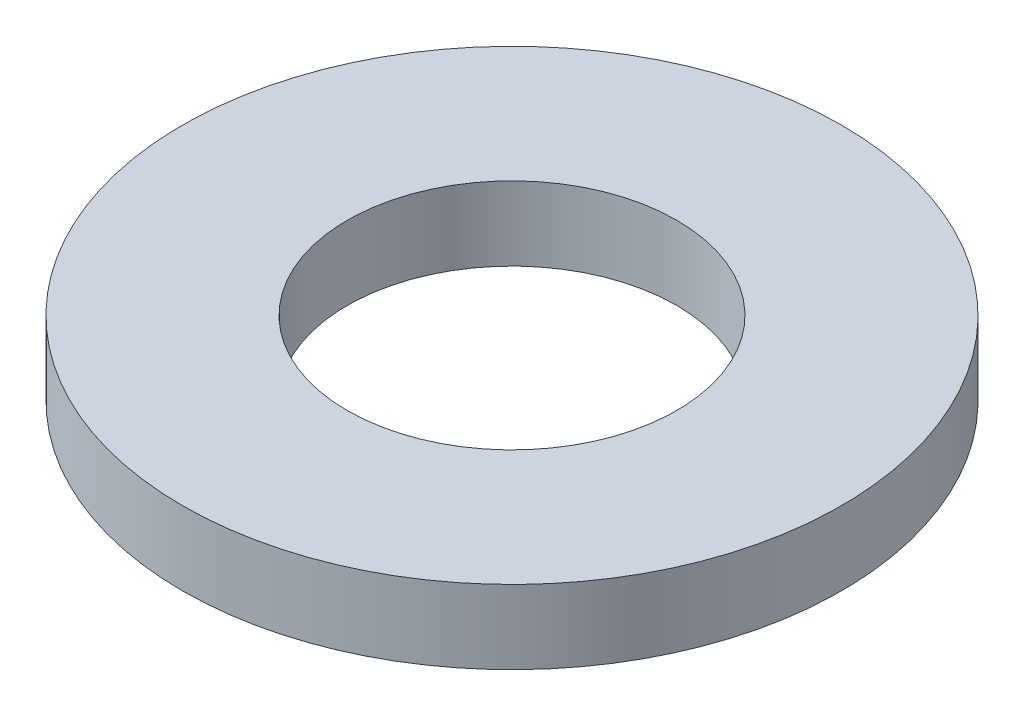
ISO-10303-21;
HEADER;
FILE_DESCRIPTION(('STEP AP214'),'2;1');
FILE_NAME('part.step','',(''),(''),'','','');
FILE_SCHEMA(('AUTOMOTIVE_DESIGN { 1 0 10303 214 1 1 1 1 }'));
ENDSEC;
DATA;
#1=APPLICATION_CONTEXT('core data for automotive mechanical design processes');
#2=APPLICATION_PROTOCOL_DEFINITION('international standard','automotive_design',2000,#1);
#3=PRODUCT_CONTEXT('',#1,'mechanical');
#4=PRODUCT('Part','Part','',(#3));
#5=PRODUCT_RELATED_PRODUCT_CATEGORY('part','',(#4));
#6=PRODUCT_DEFINITION_FORMATION('','',#4);
#7=PRODUCT_DEFINITION_CONTEXT('part definition',#1,'design');
#8=PRODUCT_DEFINITION('design','',#6,#7);
#9=PRODUCT_DEFINITION_SHAPE('','',#8);
#10=(LENGTH_UNIT() NAMED_UNIT(*) SI_UNIT(.MILLI.,.METRE.));
#11=(NAMED_UNIT(*) PLANE_ANGLE_UNIT() SI_UNIT($,.RADIAN.));
#12=(NAMED_UNIT(*) SI_UNIT($,.STERADIAN.) SOLID_ANGLE_UNIT());
#13=UNCERTAINTY_MEASURE_WITH_UNIT(LENGTH_MEASURE(1.E-05),#10,'distance_accuracy_value','');
#14=(GEOMETRIC_REPRESENTATION_CONTEXT(3) GLOBAL_UNCERTAINTY_ASSIGNED_CONTEXT((#13)) GLOBAL_UNIT_ASSIGNED_CONTEXT((#10,
#11,#12)) REPRESENTATION_CONTEXT('',''));
#15=CARTESIAN_POINT('',(0.,0.,0.));
#16=DIRECTION('',(0.,0.,1.));
#17=DIRECTION('',(1.,0.,0.));
#18=AXIS2_PLACEMENT_3D('',#15,#16,#17);
#19=CARTESIAN_POINT('',(0.,0.7112,0.));
#20=DIRECTION('',(0.,-1.,0.));
#21=DIRECTION('',(0.,0.,-1.));
#22=AXIS2_PLACEMENT_3D('',#19,#20,#21);
#23=CYLINDRICAL_SURFACE('',#22,3.175);
#24=CARTESIAN_POINT('',(0.,0.7112,0.));
#25=DIRECTION('',(0.,1.,0.));
#26=DIRECTION('',(0.,0.,1.));
#27=AXIS2_PLACEMENT_3D('',#24,#25,#26);
#28=CIRCLE('',#27,3.175);
#29=CARTESIAN_POINT('',(0.,0.7112,3.175));
#30=VERTEX_POINT('',#29);
#31=EDGE_CURVE('E12',#30,#30,#28,.T.);
#32=ORIENTED_EDGE('',*,*,#31,.F.);
#33=EDGE_LOOP('',(#32));
#34=FACE_BOUND('',#33,.T.);
#35=CARTESIAN_POINT('',(0.,0.,0.));
#36=DIRECTION('',(0.,1.,0.));
#37=DIRECTION('',(0.,0.,1.));
#38=AXIS2_PLACEMENT_3D('',#35,#36,#37);
#39=CIRCLE('',#38,3.175);
#40=CARTESIAN_POINT('',(0.,0.,3.175));
#41=VERTEX_POINT('',#40);
#42=EDGE_CURVE('E45',#41,#41,#39,.T.);
#43=ORIENTED_EDGE('',*,*,#42,.T.);
#44=EDGE_LOOP('',(#43));
#45=FACE_BOUND('',#44,.T.);
#46=ADVANCED_FACE('F42',(#34,#45),#23,.T.);
#47=CARTESIAN_POINT('',(0.,0.7112,0.));
#48=DIRECTION('',(0.,1.,0.));
#49=DIRECTION('',(0.,0.,1.));
#50=AXIS2_PLACEMENT_3D('',#47,#48,#49);
#51=PLANE('',#50);
#52=CARTESIAN_POINT('',(0.,0.7112,0.));
#53=DIRECTION('',(0.,1.,0.));
#54=DIRECTION('',(0.,0.,1.));
#55=AXIS2_PLACEMENT_3D('',#52,#53,#54);
#56=CIRCLE('',#55,1.5875);
#57=CARTESIAN_POINT('',(0.,0.7112,1.5875));
#58=VERTEX_POINT('',#57);
#59=EDGE_CURVE('E54',#58,#58,#56,.T.);
#60=ORIENTED_EDGE('',*,*,#59,.F.);
#61=EDGE_LOOP('',(#60));
#62=FACE_BOUND('',#61,.T.);
#63=ORIENTED_EDGE('',*,*,#31,.T.);
#64=EDGE_LOOP('',(#63));
#65=FACE_BOUND('',#64,.T.);
#66=ADVANCED_FACE('F69',(#62,#65),#51,.T.);
#67=CARTESIAN_POINT('',(0.,0.,0.));
#68=DIRECTION('',(0.,1.,0.));
#69=DIRECTION('',(0.,0.,1.));
#70=AXIS2_PLACEMENT_3D('',#67,#68,#69);
#71=PLANE('',#70);
#72=CARTESIAN_POINT('',(0.,0.,0.));
#73=DIRECTION('',(0.,1.,0.));
#74=DIRECTION('',(0.,0.,1.));
#75=AXIS2_PLACEMENT_3D('',#72,#73,#74);
#76=CIRCLE('',#75,1.5875);
#77=CARTESIAN_POINT('',(0.,0.,1.5875));
#78=VERTEX_POINT('',#77);
#79=EDGE_CURVE('E52',#78,#78,#76,.T.);
#80=ORIENTED_EDGE('',*,*,#79,.T.);
#81=EDGE_LOOP('',(#80));
#82=FACE_BOUND('',#81,.T.);
#83=ORIENTED_EDGE('',*,*,#42,.F.);
#84=EDGE_LOOP('',(#83));
#85=FACE_BOUND('',#84,.T.);
#86=ADVANCED_FACE('F60',(#82,#85),#71,.F.);
#87=CARTESIAN_POINT('',(0.,0.,0.));
#88=DIRECTION('',(0.,1.,0.));
#89=DIRECTION('',(0.,0.,1.));
#90=AXIS2_PLACEMENT_3D('',#87,#88,#89);
#91=CYLINDRICAL_SURFACE('',#90,1.5875);
#92=ORIENTED_EDGE('',*,*,#79,.F.);
#93=EDGE_LOOP('',(#92));
#94=FACE_BOUND('',#93,.T.);
#95=ORIENTED_EDGE('',*,*,#59,.T.);
#96=EDGE_LOOP('',(#95));
#97=FACE_BOUND('',#96,.T.);
#98=ADVANCED_FACE('F63',(#94,#97),#91,.F.);
#99=CLOSED_SHELL('',(#46,#66,#86,#98));
#100=MANIFOLD_SOLID_BREP('B2',#99);
#101=ADVANCED_BREP_SHAPE_REPRESENTATION('',(#18,#100),#14);
#102=SHAPE_DEFINITION_REPRESENTATION(#9,#101);
ENDSEC;
END-ISO-10303-21;
